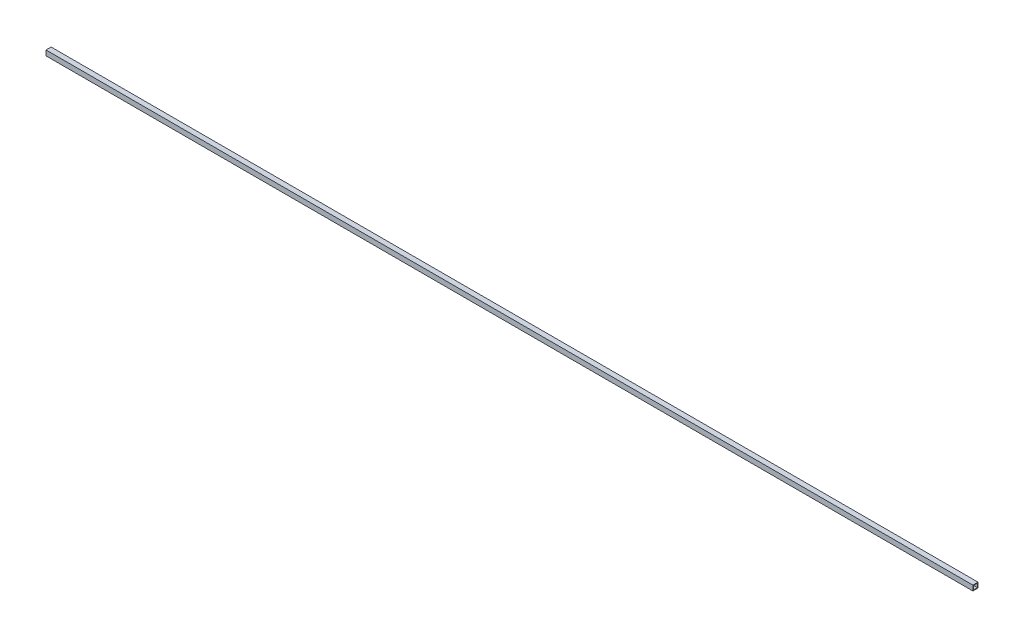
ISO-10303-21;
HEADER;
FILE_DESCRIPTION(('STEP AP214'),'2;1');
FILE_NAME('part.step','',(''),(''),'','','');
FILE_SCHEMA(('AUTOMOTIVE_DESIGN { 1 0 10303 214 1 1 1 1 }'));
ENDSEC;
DATA;
#1=APPLICATION_CONTEXT('core data for automotive mechanical design processes');
#2=APPLICATION_PROTOCOL_DEFINITION('international standard','automotive_design',2000,#1);
#3=PRODUCT_CONTEXT('',#1,'mechanical');
#4=PRODUCT('Part','Part','',(#3));
#5=PRODUCT_RELATED_PRODUCT_CATEGORY('part','',(#4));
#6=PRODUCT_DEFINITION_FORMATION('','',#4);
#7=PRODUCT_DEFINITION_CONTEXT('part definition',#1,'design');
#8=PRODUCT_DEFINITION('design','',#6,#7);
#9=PRODUCT_DEFINITION_SHAPE('','',#8);
#10=(LENGTH_UNIT() NAMED_UNIT(*) SI_UNIT(.MILLI.,.METRE.));
#11=(NAMED_UNIT(*) PLANE_ANGLE_UNIT() SI_UNIT($,.RADIAN.));
#12=(NAMED_UNIT(*) SI_UNIT($,.STERADIAN.) SOLID_ANGLE_UNIT());
#13=UNCERTAINTY_MEASURE_WITH_UNIT(LENGTH_MEASURE(1.E-05),#10,'distance_accuracy_value','');
#14=(GEOMETRIC_REPRESENTATION_CONTEXT(3) GLOBAL_UNCERTAINTY_ASSIGNED_CONTEXT((#13)) GLOBAL_UNIT_ASSIGNED_CONTEXT((#10,
#11,#12)) REPRESENTATION_CONTEXT('',''));
#15=CARTESIAN_POINT('',(0.,0.,0.));
#16=DIRECTION('',(0.,0.,1.));
#17=DIRECTION('',(1.,0.,0.));
#18=AXIS2_PLACEMENT_3D('',#15,#16,#17);
#19=CARTESIAN_POINT('',(9193.53,25.4,25.4));
#20=DIRECTION('',(0.,-1.,0.));
#21=DIRECTION('',(0.,0.,-1.));
#22=AXIS2_PLACEMENT_3D('',#19,#20,#21);
#23=PLANE('',#22);
#24=DIRECTION('',(0.,0.,1.));
#25=VECTOR('',#24,1.);
#26=CARTESIAN_POINT('',(0.,25.4,25.4));
#27=LINE('',#26,#25);
#28=CARTESIAN_POINT('',(0.,25.4,-25.4));
#29=VERTEX_POINT('',#28);
#30=CARTESIAN_POINT('',(0.,25.4,25.4));
#31=VERTEX_POINT('',#30);
#32=EDGE_CURVE('E157',#29,#31,#27,.T.);
#33=ORIENTED_EDGE('',*,*,#32,.T.);
#34=DIRECTION('',(-1.,0.,0.));
#35=VECTOR('',#34,1.);
#36=CARTESIAN_POINT('',(9193.53,25.4,25.4));
#37=LINE('',#36,#35);
#38=CARTESIAN_POINT('',(9193.53,25.4,25.4));
#39=VERTEX_POINT('',#38);
#40=EDGE_CURVE('E12',#39,#31,#37,.T.);
#41=ORIENTED_EDGE('',*,*,#40,.F.);
#42=DIRECTION('',(0.,0.,1.));
#43=VECTOR('',#42,1.);
#44=CARTESIAN_POINT('',(9193.53,25.4,25.4));
#45=LINE('',#44,#43);
#46=CARTESIAN_POINT('',(9193.53,25.4,-25.4));
#47=VERTEX_POINT('',#46);
#48=EDGE_CURVE('E131',#47,#39,#45,.T.);
#49=ORIENTED_EDGE('',*,*,#48,.F.);
#50=DIRECTION('',(-1.,0.,0.));
#51=VECTOR('',#50,1.);
#52=CARTESIAN_POINT('',(9193.53,25.4,-25.4));
#53=LINE('',#52,#51);
#54=EDGE_CURVE('E164',#47,#29,#53,.T.);
#55=ORIENTED_EDGE('',*,*,#54,.T.);
#56=EDGE_LOOP('',(#33,#41,#49,#55));
#57=FACE_BOUND('',#56,.T.);
#58=ADVANCED_FACE('F50',(#57),#23,.F.);
#59=CARTESIAN_POINT('',(9193.53,25.4,25.4));
#60=DIRECTION('',(0.,0.,-1.));
#61=DIRECTION('',(-1.,0.,0.));
#62=AXIS2_PLACEMENT_3D('',#59,#60,#61);
#63=PLANE('',#62);
#64=DIRECTION('',(0.,-1.,0.));
#65=VECTOR('',#64,1.);
#66=CARTESIAN_POINT('',(0.,25.4,25.4));
#67=LINE('',#66,#65);
#68=CARTESIAN_POINT('',(0.,-25.4,25.4));
#69=VERTEX_POINT('',#68);
#70=EDGE_CURVE('E136',#31,#69,#67,.T.);
#71=ORIENTED_EDGE('',*,*,#70,.T.);
#72=DIRECTION('',(-1.,0.,0.));
#73=VECTOR('',#72,1.);
#74=CARTESIAN_POINT('',(9193.53,-25.4,25.4));
#75=LINE('',#74,#73);
#76=CARTESIAN_POINT('',(9193.53,-25.4,25.4));
#77=VERTEX_POINT('',#76);
#78=EDGE_CURVE('E60',#77,#69,#75,.T.);
#79=ORIENTED_EDGE('',*,*,#78,.F.);
#80=DIRECTION('',(0.,-1.,0.));
#81=VECTOR('',#80,1.);
#82=CARTESIAN_POINT('',(9193.53,25.4,25.4));
#83=LINE('',#82,#81);
#84=EDGE_CURVE('E125',#39,#77,#83,.T.);
#85=ORIENTED_EDGE('',*,*,#84,.F.);
#86=ORIENTED_EDGE('',*,*,#40,.T.);
#87=EDGE_LOOP('',(#71,#79,#85,#86));
#88=FACE_BOUND('',#87,.T.);
#89=ADVANCED_FACE('F135',(#88),#63,.F.);
#90=CARTESIAN_POINT('',(9193.53,-25.4,-25.4));
#91=DIRECTION('',(0.,1.,0.));
#92=DIRECTION('',(0.,0.,1.));
#93=AXIS2_PLACEMENT_3D('',#90,#91,#92);
#94=PLANE('',#93);
#95=DIRECTION('',(0.,0.,-1.));
#96=VECTOR('',#95,1.);
#97=CARTESIAN_POINT('',(0.,-25.4,-25.4));
#98=LINE('',#97,#96);
#99=CARTESIAN_POINT('',(0.,-25.4,-25.4));
#100=VERTEX_POINT('',#99);
#101=EDGE_CURVE('E98',#69,#100,#98,.T.);
#102=ORIENTED_EDGE('',*,*,#101,.T.);
#103=DIRECTION('',(-1.,0.,0.));
#104=VECTOR('',#103,1.);
#105=CARTESIAN_POINT('',(9193.53,-25.4,-25.4));
#106=LINE('',#105,#104);
#107=CARTESIAN_POINT('',(9193.53,-25.4,-25.4));
#108=VERTEX_POINT('',#107);
#109=EDGE_CURVE('E137',#108,#100,#106,.T.);
#110=ORIENTED_EDGE('',*,*,#109,.F.);
#111=DIRECTION('',(0.,0.,-1.));
#112=VECTOR('',#111,1.);
#113=CARTESIAN_POINT('',(9193.53,-25.4,-25.4));
#114=LINE('',#113,#112);
#115=EDGE_CURVE('E129',#77,#108,#114,.T.);
#116=ORIENTED_EDGE('',*,*,#115,.F.);
#117=ORIENTED_EDGE('',*,*,#78,.T.);
#118=EDGE_LOOP('',(#102,#110,#116,#117));
#119=FACE_BOUND('',#118,.T.);
#120=ADVANCED_FACE('F139',(#119),#94,.F.);
#121=CARTESIAN_POINT('',(9193.53,19.05,19.05));
#122=DIRECTION('',(0.,0.,-1.));
#123=DIRECTION('',(-1.,0.,0.));
#124=AXIS2_PLACEMENT_3D('',#121,#122,#123);
#125=PLANE('',#124);
#126=DIRECTION('',(0.,-1.,0.));
#127=VECTOR('',#126,1.);
#128=CARTESIAN_POINT('',(0.,19.05,19.05));
#129=LINE('',#128,#127);
#130=CARTESIAN_POINT('',(0.,19.05,19.05));
#131=VERTEX_POINT('',#130);
#132=CARTESIAN_POINT('',(0.,-19.05,19.05));
#133=VERTEX_POINT('',#132);
#134=EDGE_CURVE('E145',#131,#133,#129,.T.);
#135=ORIENTED_EDGE('',*,*,#134,.F.);
#136=DIRECTION('',(-1.,0.,0.));
#137=VECTOR('',#136,1.);
#138=CARTESIAN_POINT('',(9193.53,19.05,19.05));
#139=LINE('',#138,#137);
#140=CARTESIAN_POINT('',(9193.53,19.05,19.05));
#141=VERTEX_POINT('',#140);
#142=EDGE_CURVE('E54',#141,#131,#139,.T.);
#143=ORIENTED_EDGE('',*,*,#142,.F.);
#144=DIRECTION('',(0.,-1.,0.));
#145=VECTOR('',#144,1.);
#146=CARTESIAN_POINT('',(9193.53,19.05,19.05));
#147=LINE('',#146,#145);
#148=CARTESIAN_POINT('',(9193.53,-19.05,19.05));
#149=VERTEX_POINT('',#148);
#150=EDGE_CURVE('E163',#141,#149,#147,.T.);
#151=ORIENTED_EDGE('',*,*,#150,.T.);
#152=DIRECTION('',(-1.,0.,0.));
#153=VECTOR('',#152,1.);
#154=CARTESIAN_POINT('',(9193.53,-19.05,19.05));
#155=LINE('',#154,#153);
#156=EDGE_CURVE('E141',#149,#133,#155,.T.);
#157=ORIENTED_EDGE('',*,*,#156,.T.);
#158=EDGE_LOOP('',(#135,#143,#151,#157));
#159=FACE_BOUND('',#158,.T.);
#160=ADVANCED_FACE('F52',(#159),#125,.T.);
#161=CARTESIAN_POINT('',(9193.53,19.05,19.05));
#162=DIRECTION('',(0.,-1.,0.));
#163=DIRECTION('',(0.,0.,-1.));
#164=AXIS2_PLACEMENT_3D('',#161,#162,#163);
#165=PLANE('',#164);
#166=DIRECTION('',(0.,0.,1.));
#167=VECTOR('',#166,1.);
#168=CARTESIAN_POINT('',(0.,19.05,19.05));
#169=LINE('',#168,#167);
#170=CARTESIAN_POINT('',(0.,19.05,-19.05));
#171=VERTEX_POINT('',#170);
#172=EDGE_CURVE('E148',#171,#131,#169,.T.);
#173=ORIENTED_EDGE('',*,*,#172,.F.);
#174=DIRECTION('',(-1.,0.,0.));
#175=VECTOR('',#174,1.);
#176=CARTESIAN_POINT('',(9193.53,19.05,-19.05));
#177=LINE('',#176,#175);
#178=CARTESIAN_POINT('',(9193.53,19.05,-19.05));
#179=VERTEX_POINT('',#178);
#180=EDGE_CURVE('E169',#179,#171,#177,.T.);
#181=ORIENTED_EDGE('',*,*,#180,.F.);
#182=DIRECTION('',(0.,0.,1.));
#183=VECTOR('',#182,1.);
#184=CARTESIAN_POINT('',(9193.53,19.05,19.05));
#185=LINE('',#184,#183);
#186=EDGE_CURVE('E178',#179,#141,#185,.T.);
#187=ORIENTED_EDGE('',*,*,#186,.T.);
#188=ORIENTED_EDGE('',*,*,#142,.T.);
#189=EDGE_LOOP('',(#173,#181,#187,#188));
#190=FACE_BOUND('',#189,.T.);
#191=ADVANCED_FACE('F176',(#190),#165,.T.);
#192=CARTESIAN_POINT('',(9193.53,-19.05,-19.05));
#193=DIRECTION('',(0.,0.,1.));
#194=DIRECTION('',(1.,0.,0.));
#195=AXIS2_PLACEMENT_3D('',#192,#193,#194);
#196=PLANE('',#195);
#197=DIRECTION('',(0.,1.,0.));
#198=VECTOR('',#197,1.);
#199=CARTESIAN_POINT('',(0.,-19.05,-19.05));
#200=LINE('',#199,#198);
#201=CARTESIAN_POINT('',(0.,-19.05,-19.05));
#202=VERTEX_POINT('',#201);
#203=EDGE_CURVE('E151',#202,#171,#200,.T.);
#204=ORIENTED_EDGE('',*,*,#203,.F.);
#205=DIRECTION('',(-1.,0.,0.));
#206=VECTOR('',#205,1.);
#207=CARTESIAN_POINT('',(9193.53,-19.05,-19.05));
#208=LINE('',#207,#206);
#209=CARTESIAN_POINT('',(9193.53,-19.05,-19.05));
#210=VERTEX_POINT('',#209);
#211=EDGE_CURVE('E168',#210,#202,#208,.T.);
#212=ORIENTED_EDGE('',*,*,#211,.F.);
#213=DIRECTION('',(0.,1.,0.));
#214=VECTOR('',#213,1.);
#215=CARTESIAN_POINT('',(9193.53,-19.05,-19.05));
#216=LINE('',#215,#214);
#217=EDGE_CURVE('E185',#210,#179,#216,.T.);
#218=ORIENTED_EDGE('',*,*,#217,.T.);
#219=ORIENTED_EDGE('',*,*,#180,.T.);
#220=EDGE_LOOP('',(#204,#212,#218,#219));
#221=FACE_BOUND('',#220,.T.);
#222=ADVANCED_FACE('F183',(#221),#196,.T.);
#223=CARTESIAN_POINT('',(9193.53,-19.05,-19.05));
#224=DIRECTION('',(0.,1.,0.));
#225=DIRECTION('',(0.,0.,1.));
#226=AXIS2_PLACEMENT_3D('',#223,#224,#225);
#227=PLANE('',#226);
#228=DIRECTION('',(0.,0.,-1.));
#229=VECTOR('',#228,1.);
#230=CARTESIAN_POINT('',(0.,-19.05,-19.05));
#231=LINE('',#230,#229);
#232=EDGE_CURVE('E154',#133,#202,#231,.T.);
#233=ORIENTED_EDGE('',*,*,#232,.F.);
#234=ORIENTED_EDGE('',*,*,#156,.F.);
#235=DIRECTION('',(0.,0.,-1.));
#236=VECTOR('',#235,1.);
#237=CARTESIAN_POINT('',(9193.53,-19.05,-19.05));
#238=LINE('',#237,#236);
#239=EDGE_CURVE('E190',#149,#210,#238,.T.);
#240=ORIENTED_EDGE('',*,*,#239,.T.);
#241=ORIENTED_EDGE('',*,*,#211,.T.);
#242=EDGE_LOOP('',(#233,#234,#240,#241));
#243=FACE_BOUND('',#242,.T.);
#244=ADVANCED_FACE('F192',(#243),#227,.T.);
#245=CARTESIAN_POINT('',(9193.53,-25.4,-25.4));
#246=DIRECTION('',(0.,0.,1.));
#247=DIRECTION('',(0.,-1.,0.));
#248=AXIS2_PLACEMENT_3D('',#245,#246,#247);
#249=PLANE('',#248);
#250=DIRECTION('',(0.,1.,0.));
#251=VECTOR('',#250,1.);
#252=CARTESIAN_POINT('',(0.,-25.4,-25.4));
#253=LINE('',#252,#251);
#254=EDGE_CURVE('E104',#100,#29,#253,.T.);
#255=ORIENTED_EDGE('',*,*,#254,.T.);
#256=ORIENTED_EDGE('',*,*,#54,.F.);
#257=DIRECTION('',(0.,1.,0.));
#258=VECTOR('',#257,1.);
#259=CARTESIAN_POINT('',(9193.53,-25.4,-25.4));
#260=LINE('',#259,#258);
#261=EDGE_CURVE('E69',#108,#47,#260,.T.);
#262=ORIENTED_EDGE('',*,*,#261,.F.);
#263=ORIENTED_EDGE('',*,*,#109,.T.);
#264=EDGE_LOOP('',(#255,#256,#262,#263));
#265=FACE_BOUND('',#264,.T.);
#266=ADVANCED_FACE('F197',(#265),#249,.F.);
#267=CARTESIAN_POINT('',(9193.53,0.,0.));
#268=DIRECTION('',(1.,0.,0.));
#269=DIRECTION('',(0.,0.,-1.));
#270=AXIS2_PLACEMENT_3D('',#267,#268,#269);
#271=PLANE('',#270);
#272=ORIENTED_EDGE('',*,*,#150,.F.);
#273=ORIENTED_EDGE('',*,*,#186,.F.);
#274=ORIENTED_EDGE('',*,*,#217,.F.);
#275=ORIENTED_EDGE('',*,*,#239,.F.);
#276=EDGE_LOOP('',(#272,#273,#274,#275));
#277=FACE_BOUND('',#276,.T.);
#278=ORIENTED_EDGE('',*,*,#48,.T.);
#279=ORIENTED_EDGE('',*,*,#84,.T.);
#280=ORIENTED_EDGE('',*,*,#115,.T.);
#281=ORIENTED_EDGE('',*,*,#261,.T.);
#282=EDGE_LOOP('',(#278,#279,#280,#281));
#283=FACE_BOUND('',#282,.T.);
#284=ADVANCED_FACE('F127',(#277,#283),#271,.T.);
#285=CARTESIAN_POINT('',(0.,0.,0.));
#286=DIRECTION('',(1.,0.,0.));
#287=DIRECTION('',(0.,0.,-1.));
#288=AXIS2_PLACEMENT_3D('',#285,#286,#287);
#289=PLANE('',#288);
#290=ORIENTED_EDGE('',*,*,#134,.T.);
#291=ORIENTED_EDGE('',*,*,#232,.T.);
#292=ORIENTED_EDGE('',*,*,#203,.T.);
#293=ORIENTED_EDGE('',*,*,#172,.T.);
#294=EDGE_LOOP('',(#290,#291,#292,#293));
#295=FACE_BOUND('',#294,.T.);
#296=ORIENTED_EDGE('',*,*,#32,.F.);
#297=ORIENTED_EDGE('',*,*,#254,.F.);
#298=ORIENTED_EDGE('',*,*,#101,.F.);
#299=ORIENTED_EDGE('',*,*,#70,.F.);
#300=EDGE_LOOP('',(#296,#297,#298,#299));
#301=FACE_BOUND('',#300,.T.);
#302=ADVANCED_FACE('F181',(#295,#301),#289,.F.);
#303=CLOSED_SHELL('',(#58,#89,#120,#160,#191,#222,#244,#266,#284,#302));
#304=MANIFOLD_SOLID_BREP('B2',#303);
#305=ADVANCED_BREP_SHAPE_REPRESENTATION('',(#18,#304),#14);
#306=SHAPE_DEFINITION_REPRESENTATION(#9,#305);
ENDSEC;
END-ISO-10303-21;
